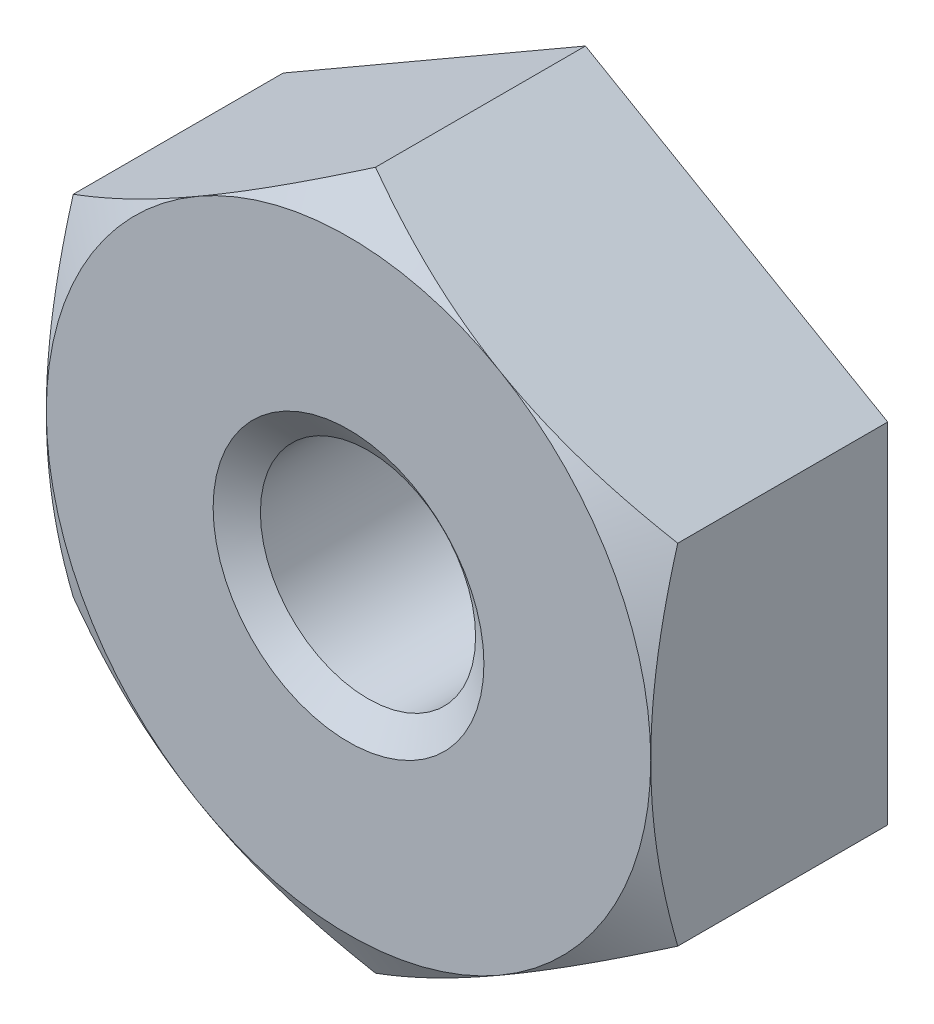
ISO-10303-21;
HEADER;
FILE_DESCRIPTION(('STEP AP214'),'2;1');
FILE_NAME('part.step','',(''),(''),'','','');
FILE_SCHEMA(('AUTOMOTIVE_DESIGN { 1 0 10303 214 1 1 1 1 }'));
ENDSEC;
DATA;
#1=APPLICATION_CONTEXT('core data for automotive mechanical design processes');
#2=APPLICATION_PROTOCOL_DEFINITION('international standard','automotive_design',2000,#1);
#3=PRODUCT_CONTEXT('',#1,'mechanical');
#4=PRODUCT('Part','Part','',(#3));
#5=PRODUCT_RELATED_PRODUCT_CATEGORY('part','',(#4));
#6=PRODUCT_DEFINITION_FORMATION('','',#4);
#7=PRODUCT_DEFINITION_CONTEXT('part definition',#1,'design');
#8=PRODUCT_DEFINITION('design','',#6,#7);
#9=PRODUCT_DEFINITION_SHAPE('','',#8);
#10=(LENGTH_UNIT() NAMED_UNIT(*) SI_UNIT(.MILLI.,.METRE.));
#11=(NAMED_UNIT(*) PLANE_ANGLE_UNIT() SI_UNIT($,.RADIAN.));
#12=(NAMED_UNIT(*) SI_UNIT($,.STERADIAN.) SOLID_ANGLE_UNIT());
#13=UNCERTAINTY_MEASURE_WITH_UNIT(LENGTH_MEASURE(1.E-05),#10,'distance_accuracy_value','');
#14=(GEOMETRIC_REPRESENTATION_CONTEXT(3) GLOBAL_UNCERTAINTY_ASSIGNED_CONTEXT((#13)) GLOBAL_UNIT_ASSIGNED_CONTEXT((#10,
#11,#12)) REPRESENTATION_CONTEXT('',''));
#15=CARTESIAN_POINT('',(0.,0.,0.));
#16=DIRECTION('',(0.,0.,1.));
#17=DIRECTION('',(1.,0.,0.));
#18=AXIS2_PLACEMENT_3D('',#15,#16,#17);
#19=CARTESIAN_POINT('',(0.,0.,-2.4892));
#20=DIRECTION('',(0.,0.,1.));
#21=DIRECTION('',(1.,0.,0.));
#22=AXIS2_PLACEMENT_3D('',#19,#20,#21);
#23=CYLINDRICAL_SURFACE('',#22,1.1303);
#24=CARTESIAN_POINT('',(0.,0.,-0.204530621911055));
#25=DIRECTION('',(0.,0.,1.));
#26=DIRECTION('',(1.,0.,0.));
#27=AXIS2_PLACEMENT_3D('',#24,#25,#26);
#28=CIRCLE('',#27,1.1303);
#29=CARTESIAN_POINT('',(1.1303,0.,-0.204530621911055));
#30=VERTEX_POINT('',#29);
#31=EDGE_CURVE('E130',#30,#30,#28,.F.);
#32=ORIENTED_EDGE('',*,*,#31,.F.);
#33=EDGE_LOOP('',(#32));
#34=FACE_BOUND('',#33,.T.);
#35=CARTESIAN_POINT('',(0.,0.,-2.25926937808894));
#36=DIRECTION('',(0.,0.,-1.));
#37=DIRECTION('',(-1.,0.,0.));
#38=AXIS2_PLACEMENT_3D('',#35,#36,#37);
#39=CIRCLE('',#38,1.1303);
#40=CARTESIAN_POINT('',(-1.1303,0.,-2.25926937808894));
#41=VERTEX_POINT('',#40);
#42=EDGE_CURVE('E36',#41,#41,#39,.F.);
#43=ORIENTED_EDGE('',*,*,#42,.F.);
#44=EDGE_LOOP('',(#43));
#45=FACE_BOUND('',#44,.T.);
#46=ADVANCED_FACE('F31',(#34,#45),#23,.F.);
#47=CARTESIAN_POINT('',(0.,3.66617420935413,-2.4892));
#48=DIRECTION('',(0.,0.,-1.));
#49=DIRECTION('',(-1.,0.,0.));
#50=AXIS2_PLACEMENT_3D('',#47,#48,#49);
#51=PLANE('',#50);
#52=DIRECTION('',(-0.866025403784437,-0.500000000000003,0.));
#53=VECTOR('',#52,1.);
#54=CARTESIAN_POINT('',(0.,3.66617420935413,-2.4892));
#55=LINE('',#54,#53);
#56=CARTESIAN_POINT('',(0.,3.66617420935413,-2.4892));
#57=VERTEX_POINT('',#56);
#58=CARTESIAN_POINT('',(-3.175,1.83308710467705,-2.4892));
#59=VERTEX_POINT('',#58);
#60=EDGE_CURVE('E257',#57,#59,#55,.T.);
#61=ORIENTED_EDGE('',*,*,#60,.F.);
#62=DIRECTION('',(-0.866025403784438,0.500000000000001,0.));
#63=VECTOR('',#62,1.);
#64=CARTESIAN_POINT('',(3.175,1.83308710467706,-2.4892));
#65=LINE('',#64,#63);
#66=CARTESIAN_POINT('',(3.175,1.83308710467706,-2.4892));
#67=VERTEX_POINT('',#66);
#68=EDGE_CURVE('E234',#67,#57,#65,.T.);
#69=ORIENTED_EDGE('',*,*,#68,.F.);
#70=DIRECTION('',(0.,-1.,0.));
#71=VECTOR('',#70,1.);
#72=CARTESIAN_POINT('',(3.175,1.83308710467706,-2.4892));
#73=LINE('',#72,#71);
#74=CARTESIAN_POINT('',(3.175,-1.83308710467707,-2.4892));
#75=VERTEX_POINT('',#74);
#76=EDGE_CURVE('E246',#67,#75,#73,.T.);
#77=ORIENTED_EDGE('',*,*,#76,.T.);
#78=DIRECTION('',(0.866025403784437,0.500000000000003,0.));
#79=VECTOR('',#78,1.);
#80=CARTESIAN_POINT('',(0.,-3.66617420935414,-2.4892));
#81=LINE('',#80,#79);
#82=CARTESIAN_POINT('',(0.,-3.66617420935414,-2.4892));
#83=VERTEX_POINT('',#82);
#84=EDGE_CURVE('E248',#83,#75,#81,.T.);
#85=ORIENTED_EDGE('',*,*,#84,.F.);
#86=DIRECTION('',(0.866025403784438,-0.500000000000001,0.));
#87=VECTOR('',#86,1.);
#88=CARTESIAN_POINT('',(-3.175,-1.83308710467707,-2.4892));
#89=LINE('',#88,#87);
#90=CARTESIAN_POINT('',(-3.175,-1.83308710467707,-2.4892));
#91=VERTEX_POINT('',#90);
#92=EDGE_CURVE('E251',#91,#83,#89,.T.);
#93=ORIENTED_EDGE('',*,*,#92,.F.);
#94=DIRECTION('',(0.,-1.,0.));
#95=VECTOR('',#94,1.);
#96=CARTESIAN_POINT('',(-3.175,1.83308710467705,-2.4892));
#97=LINE('',#96,#95);
#98=EDGE_CURVE('E254',#59,#91,#97,.T.);
#99=ORIENTED_EDGE('',*,*,#98,.F.);
#100=EDGE_LOOP('',(#61,#69,#77,#85,#93,#99));
#101=FACE_BOUND('',#100,.T.);
#102=CARTESIAN_POINT('',(0.,0.,-2.4892));
#103=DIRECTION('',(0.,0.,-1.));
#104=DIRECTION('',(-1.,0.,0.));
#105=AXIS2_PLACEMENT_3D('',#102,#103,#104);
#106=CIRCLE('',#105,1.4224);
#107=CARTESIAN_POINT('',(-1.4224,0.,-2.4892));
#108=VERTEX_POINT('',#107);
#109=EDGE_CURVE('E218',#108,#108,#106,.F.);
#110=ORIENTED_EDGE('',*,*,#109,.T.);
#111=EDGE_LOOP('',(#110));
#112=FACE_BOUND('',#111,.T.);
#113=ADVANCED_FACE('F205',(#101,#112),#51,.T.);
#114=CARTESIAN_POINT('',(0.,3.66617420935413,0.));
#115=DIRECTION('',(0.,0.,-1.));
#116=DIRECTION('',(-1.,0.,0.));
#117=AXIS2_PLACEMENT_3D('',#114,#115,#116);
#118=PLANE('',#117);
#119=CARTESIAN_POINT('',(0.,0.,0.));
#120=DIRECTION('',(0.,0.,-1.));
#121=DIRECTION('',(-1.,0.,0.));
#122=AXIS2_PLACEMENT_3D('',#119,#120,#121);
#123=CIRCLE('',#122,3.175);
#124=CARTESIAN_POINT('',(-1.58750000000001,2.74963065701559,0.));
#125=VERTEX_POINT('',#124);
#126=CARTESIAN_POINT('',(-3.175,0.,0.));
#127=VERTEX_POINT('',#126);
#128=EDGE_CURVE('E43',#125,#127,#123,.F.);
#129=ORIENTED_EDGE('',*,*,#128,.T.);
#130=CARTESIAN_POINT('',(-1.5875,-2.74963065701559,0.));
#131=VERTEX_POINT('',#130);
#132=EDGE_CURVE('E11',#127,#131,#123,.F.);
#133=ORIENTED_EDGE('',*,*,#132,.T.);
#134=CARTESIAN_POINT('',(1.58750000000001,-2.74963065701559,0.));
#135=VERTEX_POINT('',#134);
#136=EDGE_CURVE('E41',#131,#135,#123,.F.);
#137=ORIENTED_EDGE('',*,*,#136,.T.);
#138=CARTESIAN_POINT('',(3.175,0.,0.));
#139=VERTEX_POINT('',#138);
#140=EDGE_CURVE('E109',#135,#139,#123,.F.);
#141=ORIENTED_EDGE('',*,*,#140,.T.);
#142=CARTESIAN_POINT('',(0.,0.,0.));
#143=DIRECTION('',(0.,0.,1.));
#144=DIRECTION('',(1.,0.,0.));
#145=AXIS2_PLACEMENT_3D('',#142,#143,#144);
#146=CIRCLE('',#145,3.175);
#147=CARTESIAN_POINT('',(1.5875,2.74963065701559,0.));
#148=VERTEX_POINT('',#147);
#149=EDGE_CURVE('E121',#139,#148,#146,.T.);
#150=ORIENTED_EDGE('',*,*,#149,.T.);
#151=EDGE_CURVE('E136',#148,#125,#123,.F.);
#152=ORIENTED_EDGE('',*,*,#151,.T.);
#153=EDGE_LOOP('',(#129,#133,#137,#141,#150,#152));
#154=FACE_BOUND('',#153,.T.);
#155=CARTESIAN_POINT('',(0.,0.,0.));
#156=DIRECTION('',(0.,0.,1.));
#157=DIRECTION('',(1.,0.,0.));
#158=AXIS2_PLACEMENT_3D('',#155,#156,#157);
#159=CIRCLE('',#158,1.4224);
#160=CARTESIAN_POINT('',(1.4224,0.,0.));
#161=VERTEX_POINT('',#160);
#162=EDGE_CURVE('E217',#161,#161,#159,.T.);
#163=ORIENTED_EDGE('',*,*,#162,.F.);
#164=EDGE_LOOP('',(#163));
#165=FACE_BOUND('',#164,.T.);
#166=ADVANCED_FACE('F133',(#154,#165),#118,.F.);
#167=CARTESIAN_POINT('',(0.,3.66617420935413,-2.4892));
#168=DIRECTION('',(-0.500000000000003,0.866025403784437,0.));
#169=DIRECTION('',(-0.866025403784437,-0.500000000000003,0.));
#170=AXIS2_PLACEMENT_3D('',#167,#168,#169);
#171=PLANE('',#170);
#172=DIRECTION('',(0.,0.,1.));
#173=VECTOR('',#172,1.);
#174=CARTESIAN_POINT('',(-3.175,1.83308710467705,-2.4892));
#175=LINE('',#174,#173);
#176=CARTESIAN_POINT('',(-3.175,1.83308710467705,-0.283579561989608));
#177=VERTEX_POINT('',#176);
#178=EDGE_CURVE('E230',#59,#177,#175,.T.);
#179=ORIENTED_EDGE('',*,*,#178,.T.);
#180=CARTESIAN_POINT('',(-3.1752,1.83297163462322,-0.283646231805777));
#181=CARTESIAN_POINT('',(-3.03567460326018,1.91352665998974,-0.237119934023206));
#182=CARTESIAN_POINT('',(-2.89494483272887,1.99477703088899,-0.194805864908322));
#183=CARTESIAN_POINT('',(-2.61104837470026,2.15868472735379,-0.120946008708286));
#184=CARTESIAN_POINT('',(-2.46787664251628,2.24134496547055,-0.0894263509090417));
#185=CARTESIAN_POINT('',(-2.18330753500984,2.40564101629245,-0.0403611049832706));
#186=CARTESIAN_POINT('',(-2.0419539457708,2.48725154909053,-0.0224889669031259));
#187=CARTESIAN_POINT('',(-1.7585816022433,2.65085664790703,-0.00115281403229668));
#188=CARTESIAN_POINT('',(-1.61656387803407,2.73285061920892,0.00232886836810178));
#189=CARTESIAN_POINT('',(-1.35119263453263,2.88606277807967,-0.0049117007222132));
#190=CARTESIAN_POINT('',(-1.22779940341379,2.95730389328231,-0.0138561461436312));
#191=CARTESIAN_POINT('',(-0.981816852669884,3.09932198517026,-0.0422055763684448));
#192=CARTESIAN_POINT('',(-0.859228383940738,3.17009847059057,-0.0616202467099072));
#193=CARTESIAN_POINT('',(-0.612738605574498,3.31240941048281,-0.110155730811224));
#194=CARTESIAN_POINT('',(-0.488868495421443,3.38392585192423,-0.139482298472807));
#195=CARTESIAN_POINT('',(-0.242975839646996,3.52589204292736,-0.206042193662161));
#196=CARTESIAN_POINT('',(-0.120950143425915,3.59634361148865,-0.243259880449917));
#197=CARTESIAN_POINT('',(0.000199999999997795,3.66628967940797,-0.283646231805782));
#198=B_SPLINE_CURVE_WITH_KNOTS('',3,(#180,#181,#182,#183,#184,#185,#186,#187,#188,#189,#190,
#191,#192,#193,#194,#195,#196,#197),.UNSPECIFIED.,.F.,.F.,(4,2,2,2,2,2,2,2,4),(0.,
0.503278731073368,1.00776724301492,1.49976968502821,1.99116790059651,2.41904879402149,
2.84732618162394,3.28510386250598,3.72202181665389),.UNSPECIFIED.);
#199=EDGE_CURVE('E55',#177,#125,#198,.T.);
#200=ORIENTED_EDGE('',*,*,#199,.T.);
#201=CARTESIAN_POINT('',(0.,3.66617420935413,-0.283579561989609));
#202=VERTEX_POINT('',#201);
#203=EDGE_CURVE('E144',#125,#202,#198,.T.);
#204=ORIENTED_EDGE('',*,*,#203,.T.);
#205=DIRECTION('',(0.,0.,1.));
#206=VECTOR('',#205,1.);
#207=CARTESIAN_POINT('',(0.,3.66617420935413,-2.4892));
#208=LINE('',#207,#206);
#209=EDGE_CURVE('E229',#57,#202,#208,.T.);
#210=ORIENTED_EDGE('',*,*,#209,.F.);
#211=ORIENTED_EDGE('',*,*,#60,.T.);
#212=EDGE_LOOP('',(#179,#200,#204,#210,#211));
#213=FACE_BOUND('',#212,.T.);
#214=ADVANCED_FACE('F33',(#213),#171,.T.);
#215=CARTESIAN_POINT('',(3.175,1.83308710467706,-2.4892));
#216=DIRECTION('',(0.500000000000001,0.866025403784438,0.));
#217=DIRECTION('',(-0.866025403784438,0.500000000000001,0.));
#218=AXIS2_PLACEMENT_3D('',#215,#216,#217);
#219=PLANE('',#218);
#220=ORIENTED_EDGE('',*,*,#209,.T.);
#221=CARTESIAN_POINT('',(-0.000200000000002592,3.66628967940797,-0.283646231805782));
#222=CARTESIAN_POINT('',(0.139325396739816,3.58573465404144,-0.237119934023211));
#223=CARTESIAN_POINT('',(0.280055167271126,3.5044842831422,-0.194805864908326));
#224=CARTESIAN_POINT('',(0.56395162529974,3.34057658667739,-0.120946008708289));
#225=CARTESIAN_POINT('',(0.707123357483716,3.25791634856063,-0.0894263509090447));
#226=CARTESIAN_POINT('',(0.991692464990165,3.09362029773873,-0.0403611049832727));
#227=CARTESIAN_POINT('',(1.1330460542292,3.01200976494065,-0.0224889669031276));
#228=CARTESIAN_POINT('',(1.41641839775671,2.84840466612415,-0.00115281403229755));
#229=CARTESIAN_POINT('',(1.55843612196593,2.76641069482226,0.00232886836810127));
#230=CARTESIAN_POINT('',(1.82380736546737,2.61319853595151,-0.00491170072221298));
#231=CARTESIAN_POINT('',(1.94720059658621,2.54195742074887,-0.0138561461436305));
#232=CARTESIAN_POINT('',(2.19318314733012,2.39993932886093,-0.0422055763684434));
#233=CARTESIAN_POINT('',(2.31577161605926,2.32916284344061,-0.0616202467099056));
#234=CARTESIAN_POINT('',(2.5622613944255,2.18685190354837,-0.110155730811222));
#235=CARTESIAN_POINT('',(2.68613150457856,2.11533546210696,-0.139482298472804));
#236=CARTESIAN_POINT('',(2.932024160353,1.97336927110383,-0.206042193662157));
#237=CARTESIAN_POINT('',(3.05404985657409,1.90291770254253,-0.243259880449913));
#238=CARTESIAN_POINT('',(3.1752,1.83297163462322,-0.283646231805778));
#239=B_SPLINE_CURVE_WITH_KNOTS('',3,(#221,#222,#223,#224,#225,#226,#227,#228,#229,#230,#231,
#232,#233,#234,#235,#236,#237,#238),.UNSPECIFIED.,.F.,.F.,(4,2,2,2,2,2,2,2,4),(0.,
0.503278731073369,1.00776724301492,1.49976968502821,1.99116790059651,2.41904879402149,
2.84732618162394,3.28510386250598,3.72202181665389),.UNSPECIFIED.);
#240=EDGE_CURVE('E141',#202,#148,#239,.T.);
#241=ORIENTED_EDGE('',*,*,#240,.T.);
#242=CARTESIAN_POINT('',(3.175,1.83308710467707,-0.283579561989609));
#243=VERTEX_POINT('',#242);
#244=EDGE_CURVE('E124',#148,#243,#239,.T.);
#245=ORIENTED_EDGE('',*,*,#244,.T.);
#246=DIRECTION('',(0.,0.,1.));
#247=VECTOR('',#246,1.);
#248=CARTESIAN_POINT('',(3.175,1.83308710467706,-2.4892));
#249=LINE('',#248,#247);
#250=EDGE_CURVE('E140',#67,#243,#249,.T.);
#251=ORIENTED_EDGE('',*,*,#250,.F.);
#252=ORIENTED_EDGE('',*,*,#68,.T.);
#253=EDGE_LOOP('',(#220,#241,#245,#251,#252));
#254=FACE_BOUND('',#253,.T.);
#255=ADVANCED_FACE('F262',(#254),#219,.T.);
#256=CARTESIAN_POINT('',(3.175,1.83308710467706,-2.4892));
#257=DIRECTION('',(-1.,0.,0.));
#258=DIRECTION('',(0.,0.,1.));
#259=AXIS2_PLACEMENT_3D('',#256,#257,#258);
#260=PLANE('',#259);
#261=CARTESIAN_POINT('',(3.175,-4.8616171420299,-1.51932228935976));
#262=CARTESIAN_POINT('',(3.175,-4.72221668774449,-1.45195628992123));
#263=CARTESIAN_POINT('',(3.175,-4.58248664475634,-1.38525996427212));
#264=CARTESIAN_POINT('',(3.175,-4.30218917292502,-1.25358933527025));
#265=CARTESIAN_POINT('',(3.175,-4.16162160419068,-1.18861533006649));
#266=CARTESIAN_POINT('',(3.175,-3.87871153776028,-1.06042973005273));
#267=CARTESIAN_POINT('',(3.175,-3.73636348618431,-0.997230348581289));
#268=CARTESIAN_POINT('',(3.175,-3.4504974070564,-0.873546152177363));
#269=CARTESIAN_POINT('',(3.175,-3.30697944095183,-0.813061195746994));
#270=CARTESIAN_POINT('',(3.175,-3.01676360978826,-0.694809578750527));
#271=CARTESIAN_POINT('',(3.175,-2.87004833678074,-0.637085406846329));
#272=CARTESIAN_POINT('',(3.175,-2.57488727143506,-0.52615800832404));
#273=CARTESIAN_POINT('',(3.175,-2.42644128864792,-0.472955284693414));
#274=CARTESIAN_POINT('',(3.175,-2.12788752613931,-0.372500325317013));
#275=CARTESIAN_POINT('',(3.175,-1.97778404697074,-0.325235438859671));
#276=CARTESIAN_POINT('',(3.175,-1.67544317117207,-0.238191164257202));
#277=CARTESIAN_POINT('',(3.175,-1.52320646578688,-0.198409408930922));
#278=CARTESIAN_POINT('',(3.175,-1.21649515954196,-0.12826269349477));
#279=CARTESIAN_POINT('',(3.175,-1.06201997425122,-0.0979002407280034));
#280=CARTESIAN_POINT('',(3.175,-0.751207163661342,-0.0486364247633595));
#281=CARTESIAN_POINT('',(3.175,-0.594869536715698,-0.0297350716985354));
#282=CARTESIAN_POINT('',(3.175,-0.282140016767182,-0.00506556418736419));
#283=CARTESIAN_POINT('',(3.175,-0.125754853180874,0.000785733729077507));
#284=CARTESIAN_POINT('',(3.175,0.186905967950925,-0.000955727684993067));
#285=CARTESIAN_POINT('',(3.175,0.34318164338531,-0.00854499720968375));
#286=CARTESIAN_POINT('',(3.175,0.61004500421025,-0.0324474955995366));
#287=CARTESIAN_POINT('',(3.175,0.720927103340566,-0.0456480037348523));
#288=CARTESIAN_POINT('',(3.175,0.941834770691505,-0.0779568944626853));
#289=CARTESIAN_POINT('',(3.175,1.05186020102054,-0.0970662087901405));
#290=CARTESIAN_POINT('',(3.175,1.38056179828294,-0.162254462566744));
#291=CARTESIAN_POINT('',(3.175,1.59769723107173,-0.216176928599964));
#292=CARTESIAN_POINT('',(3.175,1.92260738330278,-0.309178610208029));
#293=CARTESIAN_POINT('',(3.175,2.03207569486971,-0.342672941312984));
#294=CARTESIAN_POINT('',(3.175,2.24986976286739,-0.412975885555784));
#295=CARTESIAN_POINT('',(3.175,2.35819625057448,-0.44978221272336));
#296=CARTESIAN_POINT('',(3.175,2.57325368409845,-0.52594327372435));
#297=CARTESIAN_POINT('',(3.175,2.67999017870302,-0.565282497316839));
#298=CARTESIAN_POINT('',(3.175,2.89263503540125,-0.646269943321368));
#299=CARTESIAN_POINT('',(3.175,2.99854304277513,-0.687919098952172));
#300=CARTESIAN_POINT('',(3.175,3.1040681107068,-0.730495273942545));
#301=B_SPLINE_CURVE_WITH_KNOTS('',3,(#261,#262,#263,#264,#265,#266,#267,#268,#269,#270,#271,
#272,#273,#274,#275,#276,#277,#278,#279,#280,#281,#282,#283,#284,#285,#286,#287,#288,#289,#290,
#291,#292,#293,#294,#295,#296,#297,#298,#299,#300),.UNSPECIFIED.,.F.,.F.,(4,2,2,2,2,2,2,2,2,2,2,
2,2,2,2,2,2,2,2,4),(0.,0.46448011032249,0.929040108038168,1.39625859500254,1.86345269838581,
2.33638249541752,2.80936483473484,3.2813217385372,3.7531290935448,4.22506193235102,
4.69699518840458,5.16591300646641,5.63470908917535,5.96954086780257,6.30442547160104,
6.97469308766864,7.3180994250629,7.66127053211061,8.00251004161232,8.34388843151021),.UNSPECIFIED.);
#302=CARTESIAN_POINT('',(3.175,-1.83308710467707,-0.283579561989609));
#303=VERTEX_POINT('',#302);
#304=EDGE_CURVE('E105',#303,#139,#301,.T.);
#305=ORIENTED_EDGE('',*,*,#304,.F.);
#306=DIRECTION('',(0.,0.,1.));
#307=VECTOR('',#306,1.);
#308=CARTESIAN_POINT('',(3.175,-1.83308710467707,-2.4892));
#309=LINE('',#308,#307);
#310=EDGE_CURVE('E239',#75,#303,#309,.T.);
#311=ORIENTED_EDGE('',*,*,#310,.F.);
#312=ORIENTED_EDGE('',*,*,#76,.F.);
#313=ORIENTED_EDGE('',*,*,#250,.T.);
#314=EDGE_CURVE('E118',#139,#243,#301,.T.);
#315=ORIENTED_EDGE('',*,*,#314,.F.);
#316=EDGE_LOOP('',(#305,#311,#312,#313,#315));
#317=FACE_BOUND('',#316,.T.);
#318=ADVANCED_FACE('F138',(#317),#260,.F.);
#319=CARTESIAN_POINT('',(0.,-3.66617420935414,-2.4892));
#320=DIRECTION('',(0.500000000000003,-0.866025403784437,0.));
#321=DIRECTION('',(0.866025403784437,0.500000000000003,0.));
#322=AXIS2_PLACEMENT_3D('',#319,#320,#321);
#323=PLANE('',#322);
#324=ORIENTED_EDGE('',*,*,#310,.T.);
#325=CARTESIAN_POINT('',(3.1752,-1.83297163462323,-0.283646231805781));
#326=CARTESIAN_POINT('',(3.03567460326018,-1.91352665998975,-0.23711993402321));
#327=CARTESIAN_POINT('',(2.89494483272887,-1.994777030889,-0.194805864908325));
#328=CARTESIAN_POINT('',(2.61104837470026,-2.1586847273538,-0.12094600870829));
#329=CARTESIAN_POINT('',(2.46787664251628,-2.24134496547057,-0.089426350909046));
#330=CARTESIAN_POINT('',(2.18330753500983,-2.40564101629247,-0.0403611049832756));
#331=CARTESIAN_POINT('',(2.0419539457708,-2.48725154909054,-0.0224889669031313));
#332=CARTESIAN_POINT('',(1.75858160224329,-2.65085664790705,-0.00115281403230271));
#333=CARTESIAN_POINT('',(1.61656387803407,-2.73285061920894,0.00232886836809552));
#334=CARTESIAN_POINT('',(1.35119263453262,-2.88606277807969,-0.00491170072221993));
#335=CARTESIAN_POINT('',(1.22779940341379,-2.95730389328232,-0.0138561461436381));
#336=CARTESIAN_POINT('',(0.981816852669881,-3.09932198517027,-0.0422055763684521));
#337=CARTESIAN_POINT('',(0.859228383940735,-3.17009847059059,-0.0616202467099147));
#338=CARTESIAN_POINT('',(0.612738605574495,-3.31240941048283,-0.110155730811232));
#339=CARTESIAN_POINT('',(0.48886849542144,-3.38392585192424,-0.139482298472814));
#340=CARTESIAN_POINT('',(0.242975839646995,-3.52589204292737,-0.206042193662168));
#341=CARTESIAN_POINT('',(0.120950143425913,-3.59634361148867,-0.243259880449925));
#342=CARTESIAN_POINT('',(-0.000199999999999131,-3.66628967940798,-0.283646231805789));
#343=B_SPLINE_CURVE_WITH_KNOTS('',3,(#325,#326,#327,#328,#329,#330,#331,#332,#333,#334,#335,
#336,#337,#338,#339,#340,#341,#342),.UNSPECIFIED.,.F.,.F.,(4,2,2,2,2,2,2,2,4),(0.,
0.503278731073368,1.00776724301492,1.49976968502821,1.99116790059651,2.41904879402149,
2.84732618162394,3.28510386250597,3.72202181665389),.UNSPECIFIED.);
#344=EDGE_CURVE('E112',#303,#135,#343,.T.);
#345=ORIENTED_EDGE('',*,*,#344,.T.);
#346=CARTESIAN_POINT('',(0.,-3.66617420935413,-0.283579561989609));
#347=VERTEX_POINT('',#346);
#348=EDGE_CURVE('E151',#135,#347,#343,.T.);
#349=ORIENTED_EDGE('',*,*,#348,.T.);
#350=DIRECTION('',(0.,0.,1.));
#351=VECTOR('',#350,1.);
#352=CARTESIAN_POINT('',(0.,-3.66617420935414,-2.4892));
#353=LINE('',#352,#351);
#354=EDGE_CURVE('E236',#83,#347,#353,.T.);
#355=ORIENTED_EDGE('',*,*,#354,.F.);
#356=ORIENTED_EDGE('',*,*,#84,.T.);
#357=EDGE_LOOP('',(#324,#345,#349,#355,#356));
#358=FACE_BOUND('',#357,.T.);
#359=ADVANCED_FACE('F193',(#358),#323,.T.);
#360=CARTESIAN_POINT('',(-3.175,-1.83308710467707,-2.4892));
#361=DIRECTION('',(-0.500000000000001,-0.866025403784438,0.));
#362=DIRECTION('',(0.866025403784438,-0.500000000000001,0.));
#363=AXIS2_PLACEMENT_3D('',#360,#361,#362);
#364=PLANE('',#363);
#365=ORIENTED_EDGE('',*,*,#354,.T.);
#366=CARTESIAN_POINT('',(0.000200000000000635,-3.66628967940798,-0.28364623180579));
#367=CARTESIAN_POINT('',(-0.139325396739819,-3.58573465404145,-0.237119934023219));
#368=CARTESIAN_POINT('',(-0.280055167271129,-3.50448428314221,-0.194805864908333));
#369=CARTESIAN_POINT('',(-0.563951625299744,-3.34057658667741,-0.120946008708296));
#370=CARTESIAN_POINT('',(-0.70712335748372,-3.25791634856064,-0.0894263509090518));
#371=CARTESIAN_POINT('',(-0.99169246499017,-3.09362029773874,-0.0403611049832797));
#372=CARTESIAN_POINT('',(-1.1330460542292,-3.01200976494067,-0.0224889669031346));
#373=CARTESIAN_POINT('',(-1.41641839775671,-2.84840466612416,-0.00115281403230467));
#374=CARTESIAN_POINT('',(-1.55843612196593,-2.76641069482227,0.0023288683680941));
#375=CARTESIAN_POINT('',(-1.82380736546738,-2.61319853595152,-0.0049117007222203));
#376=CARTESIAN_POINT('',(-1.94720059658622,-2.54195742074889,-0.0138561461436378));
#377=CARTESIAN_POINT('',(-2.19318314733012,-2.39993932886094,-0.0422055763684505));
#378=CARTESIAN_POINT('',(-2.31577161605927,-2.32916284344062,-0.0616202467099124));
#379=CARTESIAN_POINT('',(-2.56226139442551,-2.18685190354838,-0.110155730811228));
#380=CARTESIAN_POINT('',(-2.68613150457856,-2.11533546210697,-0.13948229847281));
#381=CARTESIAN_POINT('',(-2.93202416035301,-1.97336927110384,-0.206042193662163));
#382=CARTESIAN_POINT('',(-3.05404985657409,-1.90291770254255,-0.243259880449918));
#383=CARTESIAN_POINT('',(-3.1752,-1.83297163462324,-0.283646231805783));
#384=B_SPLINE_CURVE_WITH_KNOTS('',3,(#366,#367,#368,#369,#370,#371,#372,#373,#374,#375,#376,
#377,#378,#379,#380,#381,#382,#383),.UNSPECIFIED.,.F.,.F.,(4,2,2,2,2,2,2,2,4),(0.,
0.503278731073371,1.00776724301493,1.49976968502822,1.99116790059652,2.41904879402149,
2.84732618162395,3.28510386250598,3.72202181665389),.UNSPECIFIED.);
#385=EDGE_CURVE('E187',#347,#131,#384,.T.);
#386=ORIENTED_EDGE('',*,*,#385,.T.);
#387=CARTESIAN_POINT('',(-3.175,-1.83308710467707,-0.283579561989609));
#388=VERTEX_POINT('',#387);
#389=EDGE_CURVE('E180',#131,#388,#384,.T.);
#390=ORIENTED_EDGE('',*,*,#389,.T.);
#391=DIRECTION('',(0.,0.,1.));
#392=VECTOR('',#391,1.);
#393=CARTESIAN_POINT('',(-3.175,-1.83308710467707,-2.4892));
#394=LINE('',#393,#392);
#395=EDGE_CURVE('E233',#91,#388,#394,.T.);
#396=ORIENTED_EDGE('',*,*,#395,.F.);
#397=ORIENTED_EDGE('',*,*,#92,.T.);
#398=EDGE_LOOP('',(#365,#386,#390,#396,#397));
#399=FACE_BOUND('',#398,.T.);
#400=ADVANCED_FACE('F189',(#399),#364,.T.);
#401=CARTESIAN_POINT('',(-3.175,1.83308710467705,-2.4892));
#402=DIRECTION('',(-1.,0.,0.));
#403=DIRECTION('',(0.,0.,1.));
#404=AXIS2_PLACEMENT_3D('',#401,#402,#403);
#405=PLANE('',#404);
#406=ORIENTED_EDGE('',*,*,#395,.T.);
#407=CARTESIAN_POINT('',(-3.175,-4.8616171420299,-1.51932228935977));
#408=CARTESIAN_POINT('',(-3.175,-4.7222166877445,-1.45195628992123));
#409=CARTESIAN_POINT('',(-3.175,-4.58248664475634,-1.38525996427213));
#410=CARTESIAN_POINT('',(-3.175,-4.30218917292502,-1.25358933527026));
#411=CARTESIAN_POINT('',(-3.175,-4.16162160419068,-1.1886153300665));
#412=CARTESIAN_POINT('',(-3.175,-3.87871153776028,-1.06042973005274));
#413=CARTESIAN_POINT('',(-3.175,-3.73636348618432,-0.997230348581292));
#414=CARTESIAN_POINT('',(-3.175,-3.45049740705641,-0.873546152177366));
#415=CARTESIAN_POINT('',(-3.175,-3.30697944095184,-0.813061195746996));
#416=CARTESIAN_POINT('',(-3.175,-3.01676360978827,-0.694809578750529));
#417=CARTESIAN_POINT('',(-3.175,-2.87004833678074,-0.637085406846331));
#418=CARTESIAN_POINT('',(-3.175,-2.57488727143507,-0.526158008324043));
#419=CARTESIAN_POINT('',(-3.175,-2.42644128864793,-0.472955284693416));
#420=CARTESIAN_POINT('',(-3.175,-2.12788752613931,-0.372500325317015));
#421=CARTESIAN_POINT('',(-3.175,-1.97778404697074,-0.325235438859673));
#422=CARTESIAN_POINT('',(-3.175,-1.67544317117207,-0.238191164257204));
#423=CARTESIAN_POINT('',(-3.175,-1.52320646578689,-0.198409408930924));
#424=CARTESIAN_POINT('',(-3.175,-1.21649515954197,-0.128262693494772));
#425=CARTESIAN_POINT('',(-3.175,-1.06201997425123,-0.0979002407280051));
#426=CARTESIAN_POINT('',(-3.175,-0.751207163661346,-0.0486364247633609));
#427=CARTESIAN_POINT('',(-3.175,-0.594869536715702,-0.0297350716985367));
#428=CARTESIAN_POINT('',(-3.175,-0.282140016767186,-0.00506556418736533));
#429=CARTESIAN_POINT('',(-3.175,-0.125754853180878,0.000785733729076412));
#430=CARTESIAN_POINT('',(-3.175,0.186905967950922,-0.000955727684993975));
#431=CARTESIAN_POINT('',(-3.175,0.343181643385307,-0.00854499720968451));
#432=CARTESIAN_POINT('',(-3.175,0.610045004210248,-0.0324474955995374));
#433=CARTESIAN_POINT('',(-3.175,0.720927103340563,-0.045648003734853));
#434=CARTESIAN_POINT('',(-3.175,0.941834770691503,-0.0779568944626861));
#435=CARTESIAN_POINT('',(-3.175,1.05186020102054,-0.0970662087901411));
#436=CARTESIAN_POINT('',(-3.175,1.38056179828294,-0.162254462566745));
#437=CARTESIAN_POINT('',(-3.175,1.59769723107172,-0.216176928599964));
#438=CARTESIAN_POINT('',(-3.175,1.92260738330277,-0.309178610208029));
#439=CARTESIAN_POINT('',(-3.175,2.0320756948697,-0.342672941312984));
#440=CARTESIAN_POINT('',(-3.175,2.24986976286738,-0.412975885555784));
#441=CARTESIAN_POINT('',(-3.175,2.35819625057448,-0.44978221272336));
#442=CARTESIAN_POINT('',(-3.175,2.57325368409844,-0.52594327372435));
#443=CARTESIAN_POINT('',(-3.175,2.67999017870302,-0.565282497316838));
#444=CARTESIAN_POINT('',(-3.175,2.89263503540124,-0.646269943321367));
#445=CARTESIAN_POINT('',(-3.175,2.99854304277512,-0.687919098952171));
#446=CARTESIAN_POINT('',(-3.175,3.10406811070679,-0.730495273942545));
#447=B_SPLINE_CURVE_WITH_KNOTS('',3,(#407,#408,#409,#410,#411,#412,#413,#414,#415,#416,#417,
#418,#419,#420,#421,#422,#423,#424,#425,#426,#427,#428,#429,#430,#431,#432,#433,#434,#435,#436,
#437,#438,#439,#440,#441,#442,#443,#444,#445,#446),.UNSPECIFIED.,.F.,.F.,(4,2,2,2,2,2,2,2,2,2,2,
2,2,2,2,2,2,2,2,4),(0.,0.464480110322491,0.929040108038169,1.39625859500254,1.86345269838582,
2.33638249541753,2.80936483473485,3.28132173853721,3.75312909354481,4.22506193235103,
4.69699518840458,5.16591300646642,5.63470908917535,5.96954086780258,6.30442547160104,
6.97469308766865,7.31809942506291,7.66127053211061,8.00251004161233,8.34388843151022),.UNSPECIFIED.);
#448=EDGE_CURVE('E188',#388,#127,#447,.T.);
#449=ORIENTED_EDGE('',*,*,#448,.T.);
#450=EDGE_CURVE('E129',#127,#177,#447,.T.);
#451=ORIENTED_EDGE('',*,*,#450,.T.);
#452=ORIENTED_EDGE('',*,*,#178,.F.);
#453=ORIENTED_EDGE('',*,*,#98,.T.);
#454=EDGE_LOOP('',(#406,#449,#451,#452,#453));
#455=FACE_BOUND('',#454,.T.);
#456=ADVANCED_FACE('F192',(#455),#405,.T.);
#457=CARTESIAN_POINT('',(0.,0.,0.));
#458=DIRECTION('',(0.,0.,-1.));
#459=DIRECTION('',(-1.,0.,0.));
#460=AXIS2_PLACEMENT_3D('',#457,#458,#459);
#461=CONICAL_SURFACE('',#460,3.175,1.0471975511966);
#462=ORIENTED_EDGE('',*,*,#450,.F.);
#463=ORIENTED_EDGE('',*,*,#128,.F.);
#464=ORIENTED_EDGE('',*,*,#199,.F.);
#465=EDGE_LOOP('',(#462,#463,#464));
#466=FACE_BOUND('',#465,.T.);
#467=ADVANCED_FACE('F198',(#466),#461,.T.);
#468=ORIENTED_EDGE('',*,*,#151,.F.);
#469=ORIENTED_EDGE('',*,*,#240,.F.);
#470=ORIENTED_EDGE('',*,*,#203,.F.);
#471=EDGE_LOOP('',(#468,#469,#470));
#472=FACE_BOUND('',#471,.T.);
#473=ADVANCED_FACE('F169',(#472),#461,.T.);
#474=ORIENTED_EDGE('',*,*,#149,.F.);
#475=ORIENTED_EDGE('',*,*,#314,.T.);
#476=ORIENTED_EDGE('',*,*,#244,.F.);
#477=EDGE_LOOP('',(#474,#475,#476));
#478=FACE_BOUND('',#477,.T.);
#479=ADVANCED_FACE('F122',(#478),#461,.T.);
#480=ORIENTED_EDGE('',*,*,#304,.T.);
#481=ORIENTED_EDGE('',*,*,#140,.F.);
#482=ORIENTED_EDGE('',*,*,#344,.F.);
#483=EDGE_LOOP('',(#480,#481,#482));
#484=FACE_BOUND('',#483,.T.);
#485=ADVANCED_FACE('F107',(#484),#461,.T.);
#486=ORIENTED_EDGE('',*,*,#136,.F.);
#487=ORIENTED_EDGE('',*,*,#385,.F.);
#488=ORIENTED_EDGE('',*,*,#348,.F.);
#489=EDGE_LOOP('',(#486,#487,#488));
#490=FACE_BOUND('',#489,.T.);
#491=ADVANCED_FACE('F168',(#490),#461,.T.);
#492=ORIENTED_EDGE('',*,*,#132,.F.);
#493=ORIENTED_EDGE('',*,*,#448,.F.);
#494=ORIENTED_EDGE('',*,*,#389,.F.);
#495=EDGE_LOOP('',(#492,#493,#494));
#496=FACE_BOUND('',#495,.T.);
#497=ADVANCED_FACE('F162',(#496),#461,.T.);
#498=CARTESIAN_POINT('',(0.,0.,-0.224983684102162));
#499=DIRECTION('',(0.,0.,1.));
#500=DIRECTION('',(1.,0.,0.));
#501=AXIS2_PLACEMENT_3D('',#498,#499,#500);
#502=CONICAL_SURFACE('',#501,1.10109,0.959931088596882);
#503=ORIENTED_EDGE('',*,*,#162,.T.);
#504=EDGE_LOOP('',(#503));
#505=FACE_BOUND('',#504,.T.);
#506=ORIENTED_EDGE('',*,*,#31,.T.);
#507=EDGE_LOOP('',(#506));
#508=FACE_BOUND('',#507,.T.);
#509=ADVANCED_FACE('F167',(#505,#508),#502,.F.);
#510=CARTESIAN_POINT('',(0.,0.,-2.4638));
#511=DIRECTION('',(0.,0.,-1.));
#512=DIRECTION('',(-1.,0.,0.));
#513=AXIS2_PLACEMENT_3D('',#510,#511,#512);
#514=CONICAL_SURFACE('',#513,1.4224,0.959931088596882);
#515=CARTESIAN_POINT('',(0.,0.,-2.4638));
#516=DIRECTION('',(0.,0.,1.));
#517=DIRECTION('',(1.,0.,0.));
#518=AXIS2_PLACEMENT_3D('',#515,#516,#517);
#519=CIRCLE('',#518,1.4224);
#520=CARTESIAN_POINT('',(1.4224,0.,-2.4638));
#521=VERTEX_POINT('',#520);
#522=EDGE_CURVE('E222',#521,#521,#519,.T.);
#523=ORIENTED_EDGE('',*,*,#522,.F.);
#524=EDGE_LOOP('',(#523));
#525=FACE_BOUND('',#524,.T.);
#526=ORIENTED_EDGE('',*,*,#42,.T.);
#527=EDGE_LOOP('',(#526));
#528=FACE_BOUND('',#527,.T.);
#529=ADVANCED_FACE('F308',(#525,#528),#514,.F.);
#530=CARTESIAN_POINT('',(0.,0.,-25.0375057290932));
#531=DIRECTION('',(0.,0.,1.));
#532=DIRECTION('',(1.,0.,0.));
#533=AXIS2_PLACEMENT_3D('',#530,#531,#532);
#534=CYLINDRICAL_SURFACE('',#533,1.4224);
#535=ORIENTED_EDGE('',*,*,#109,.F.);
#536=EDGE_LOOP('',(#535));
#537=FACE_BOUND('',#536,.T.);
#538=ORIENTED_EDGE('',*,*,#522,.T.);
#539=EDGE_LOOP('',(#538));
#540=FACE_BOUND('',#539,.T.);
#541=ADVANCED_FACE('F315',(#537,#540),#534,.F.);
#542=CLOSED_SHELL('',(#46,#113,#166,#214,#255,#318,#359,#400,#456,#467,#473,#479,#485,#491,#497,
#509,#529,#541));
#543=MANIFOLD_SOLID_BREP('B2',#542);
#544=ADVANCED_BREP_SHAPE_REPRESENTATION('',(#18,#543),#14);
#545=SHAPE_DEFINITION_REPRESENTATION(#9,#544);
ENDSEC;
END-ISO-10303-21;
